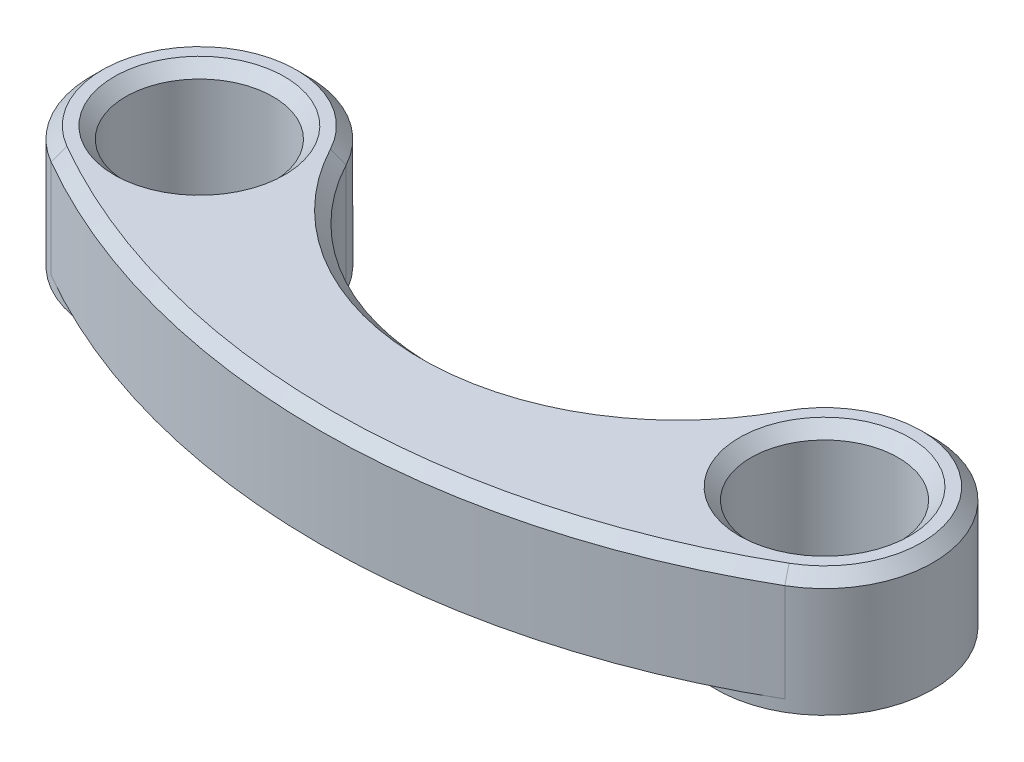
ISO-10303-21;
HEADER;
FILE_DESCRIPTION(('STEP AP214'),'2;1');
FILE_NAME('part.step','',(''),(''),'','','');
FILE_SCHEMA(('AUTOMOTIVE_DESIGN { 1 0 10303 214 1 1 1 1 }'));
ENDSEC;
DATA;
#1=APPLICATION_CONTEXT('core data for automotive mechanical design processes');
#2=APPLICATION_PROTOCOL_DEFINITION('international standard','automotive_design',2000,#1);
#3=PRODUCT_CONTEXT('',#1,'mechanical');
#4=PRODUCT('Part','Part','',(#3));
#5=PRODUCT_RELATED_PRODUCT_CATEGORY('part','',(#4));
#6=PRODUCT_DEFINITION_FORMATION('','',#4);
#7=PRODUCT_DEFINITION_CONTEXT('part definition',#1,'design');
#8=PRODUCT_DEFINITION('design','',#6,#7);
#9=PRODUCT_DEFINITION_SHAPE('','',#8);
#10=(LENGTH_UNIT() NAMED_UNIT(*) SI_UNIT(.MILLI.,.METRE.));
#11=(NAMED_UNIT(*) PLANE_ANGLE_UNIT() SI_UNIT($,.RADIAN.));
#12=(NAMED_UNIT(*) SI_UNIT($,.STERADIAN.) SOLID_ANGLE_UNIT());
#13=UNCERTAINTY_MEASURE_WITH_UNIT(LENGTH_MEASURE(1.E-05),#10,'distance_accuracy_value','');
#14=(GEOMETRIC_REPRESENTATION_CONTEXT(3) GLOBAL_UNCERTAINTY_ASSIGNED_CONTEXT((#13)) GLOBAL_UNIT_ASSIGNED_CONTEXT((#10,
#11,#12)) REPRESENTATION_CONTEXT('',''));
#15=CARTESIAN_POINT('',(0.,0.,0.));
#16=DIRECTION('',(0.,0.,1.));
#17=DIRECTION('',(1.,0.,0.));
#18=AXIS2_PLACEMENT_3D('',#15,#16,#17);
#19=CARTESIAN_POINT('',(5.41265877365273,-10.8,-3.1249999999999));
#20=DIRECTION('',(0.,1.,0.));
#21=DIRECTION('',(0.,0.,1.));
#22=AXIS2_PLACEMENT_3D('',#19,#20,#21);
#23=PLANE('',#22);
#24=CARTESIAN_POINT('',(10.8253175473055,-10.8,6.25000000000005));
#25=DIRECTION('',(0.,-1.,0.));
#26=DIRECTION('',(0.,0.,-1.));
#27=AXIS2_PLACEMENT_3D('',#24,#25,#26);
#28=CIRCLE('',#27,3.75765067213125);
#29=CARTESIAN_POINT('',(12.7041428833711,-10.8,9.50422094061338));
#30=VERTEX_POINT('',#29);
#31=CARTESIAN_POINT('',(7.50675652401322,-10.8,4.48730566788965));
#32=VERTEX_POINT('',#31);
#33=EDGE_CURVE('E109',#30,#32,#28,.T.);
#34=ORIENTED_EDGE('',*,*,#33,.F.);
#35=CARTESIAN_POINT('',(0.,-10.8,-12.4999999999998));
#36=DIRECTION('',(0.,-1.,0.));
#37=DIRECTION('',(0.,0.,1.));
#38=AXIS2_PLACEMENT_3D('',#35,#36,#37);
#39=CIRCLE('',#38,25.4082857667421);
#40=CARTESIAN_POINT('',(-12.7041428833711,-10.8,9.50422094061338));
#41=VERTEX_POINT('',#40);
#42=EDGE_CURVE('E93',#30,#41,#39,.T.);
#43=ORIENTED_EDGE('',*,*,#42,.T.);
#44=CARTESIAN_POINT('',(-10.8253175473054,-10.8,6.25000000000004));
#45=DIRECTION('',(0.,-1.,0.));
#46=DIRECTION('',(0.,0.,-1.));
#47=AXIS2_PLACEMENT_3D('',#44,#45,#46);
#48=CIRCLE('',#47,3.75765067213125);
#49=CARTESIAN_POINT('',(-7.50675652401322,-10.8,4.48730566788966));
#50=VERTEX_POINT('',#49);
#51=EDGE_CURVE('E123',#50,#41,#48,.T.);
#52=ORIENTED_EDGE('',*,*,#51,.F.);
#53=CARTESIAN_POINT('',(0.,-10.8,0.500000000000006));
#54=DIRECTION('',(0.,1.,0.));
#55=DIRECTION('',(0.,0.,1.));
#56=AXIS2_PLACEMENT_3D('',#53,#54,#55);
#57=CIRCLE('',#56,8.5);
#58=EDGE_CURVE('E103',#50,#32,#57,.T.);
#59=ORIENTED_EDGE('',*,*,#58,.T.);
#60=EDGE_LOOP('',(#34,#43,#52,#59));
#61=FACE_BOUND('',#60,.T.);
#62=ADVANCED_FACE('F36',(#61),#23,.F.);
#63=CARTESIAN_POINT('',(5.41265877365273,-7.,-3.1249999999999));
#64=DIRECTION('',(0.,1.,0.));
#65=DIRECTION('',(0.,0.,1.));
#66=AXIS2_PLACEMENT_3D('',#63,#64,#65);
#67=PLANE('',#66);
#68=CARTESIAN_POINT('',(10.8253175473055,-7.,6.25000000000005));
#69=DIRECTION('',(0.,1.,0.));
#70=DIRECTION('',(0.,0.,1.));
#71=AXIS2_PLACEMENT_3D('',#68,#69,#70);
#72=CIRCLE('',#71,2.94999999999999);
#73=CARTESIAN_POINT('',(10.8253175473055,-7.,9.20000000000004));
#74=VERTEX_POINT('',#73);
#75=EDGE_CURVE('E144',#74,#74,#72,.F.);
#76=ORIENTED_EDGE('',*,*,#75,.T.);
#77=EDGE_LOOP('',(#76));
#78=FACE_BOUND('',#77,.T.);
#79=CARTESIAN_POINT('',(0.,-7.,0.500000000000006));
#80=DIRECTION('',(0.,1.,0.));
#81=DIRECTION('',(0.,0.,1.));
#82=AXIS2_PLACEMENT_3D('',#79,#80,#81);
#83=CIRCLE('',#82,8.90000000000002);
#84=CARTESIAN_POINT('',(7.86001565455505,-7.,4.67494358167271));
#85=VERTEX_POINT('',#84);
#86=CARTESIAN_POINT('',(-7.86001565455503,-7.,4.67494358167271));
#87=VERTEX_POINT('',#86);
#88=EDGE_CURVE('E139',#85,#87,#83,.F.);
#89=ORIENTED_EDGE('',*,*,#88,.T.);
#90=CARTESIAN_POINT('',(-10.8253175473054,-7.,6.25000000000004));
#91=DIRECTION('',(0.,1.,0.));
#92=DIRECTION('',(0.,0.,1.));
#93=AXIS2_PLACEMENT_3D('',#90,#91,#92);
#94=CIRCLE('',#93,3.35765067213123);
#95=CARTESIAN_POINT('',(-12.5041428833711,-7.,9.15781077909958));
#96=VERTEX_POINT('',#95);
#97=EDGE_CURVE('E141',#87,#96,#94,.T.);
#98=ORIENTED_EDGE('',*,*,#97,.T.);
#99=CARTESIAN_POINT('',(0.,-7.,-12.4999999999998));
#100=DIRECTION('',(0.,1.,0.));
#101=DIRECTION('',(0.,0.,1.));
#102=AXIS2_PLACEMENT_3D('',#99,#100,#101);
#103=CIRCLE('',#102,25.0082857667421);
#104=CARTESIAN_POINT('',(12.5041428833711,-7.,9.15781077909958));
#105=VERTEX_POINT('',#104);
#106=EDGE_CURVE('E135',#96,#105,#103,.T.);
#107=ORIENTED_EDGE('',*,*,#106,.T.);
#108=CARTESIAN_POINT('',(10.8253175473055,-7.,6.25000000000005));
#109=DIRECTION('',(0.,1.,0.));
#110=DIRECTION('',(0.,0.,1.));
#111=AXIS2_PLACEMENT_3D('',#108,#109,#110);
#112=CIRCLE('',#111,3.35765067213123);
#113=EDGE_CURVE('E137',#105,#85,#112,.T.);
#114=ORIENTED_EDGE('',*,*,#113,.T.);
#115=EDGE_LOOP('',(#89,#98,#107,#114));
#116=FACE_BOUND('',#115,.T.);
#117=CARTESIAN_POINT('',(-10.8253175473054,-7.,6.25000000000004));
#118=DIRECTION('',(0.,1.,0.));
#119=DIRECTION('',(0.,0.,1.));
#120=AXIS2_PLACEMENT_3D('',#117,#118,#119);
#121=CIRCLE('',#120,2.94999999999999);
#122=CARTESIAN_POINT('',(-10.8253175473054,-7.,9.20000000000004));
#123=VERTEX_POINT('',#122);
#124=EDGE_CURVE('E132',#123,#123,#121,.F.);
#125=ORIENTED_EDGE('',*,*,#124,.T.);
#126=EDGE_LOOP('',(#125));
#127=FACE_BOUND('',#126,.T.);
#128=ADVANCED_FACE('F174',(#78,#116,#127),#67,.T.);
#129=CARTESIAN_POINT('',(0.,-10.8,-12.4999999999998));
#130=DIRECTION('',(0.,1.,0.));
#131=DIRECTION('',(0.,0.,1.));
#132=AXIS2_PLACEMENT_3D('',#129,#130,#131);
#133=CYLINDRICAL_SURFACE('',#132,25.4082857667421);
#134=DIRECTION('',(0.,1.,0.));
#135=VECTOR('',#134,1.);
#136=CARTESIAN_POINT('',(12.7041428833711,-10.8,9.50422094061338));
#137=LINE('',#136,#135);
#138=CARTESIAN_POINT('',(12.7041428833711,-7.40000000000002,9.50422094061338));
#139=VERTEX_POINT('',#138);
#140=EDGE_CURVE('E95',#30,#139,#137,.T.);
#141=ORIENTED_EDGE('',*,*,#140,.T.);
#142=CARTESIAN_POINT('',(0.,-7.40000000000002,-12.4999999999998));
#143=DIRECTION('',(0.,1.,0.));
#144=DIRECTION('',(0.,0.,1.));
#145=AXIS2_PLACEMENT_3D('',#142,#143,#144);
#146=CIRCLE('',#145,25.4082857667421);
#147=CARTESIAN_POINT('',(-12.7041428833711,-7.40000000000002,9.50422094061338));
#148=VERTEX_POINT('',#147);
#149=EDGE_CURVE('E45',#139,#148,#146,.F.);
#150=ORIENTED_EDGE('',*,*,#149,.T.);
#151=DIRECTION('',(0.,1.,0.));
#152=VECTOR('',#151,1.);
#153=CARTESIAN_POINT('',(-12.7041428833711,-10.8,9.50422094061338));
#154=LINE('',#153,#152);
#155=EDGE_CURVE('E98',#41,#148,#154,.T.);
#156=ORIENTED_EDGE('',*,*,#155,.F.);
#157=ORIENTED_EDGE('',*,*,#42,.F.);
#158=EDGE_LOOP('',(#141,#150,#156,#157));
#159=FACE_BOUND('',#158,.T.);
#160=ADVANCED_FACE('F94',(#159),#133,.T.);
#161=CARTESIAN_POINT('',(-10.8253175473054,-10.8,6.25000000000004));
#162=DIRECTION('',(0.,1.,0.));
#163=DIRECTION('',(0.,0.,1.));
#164=AXIS2_PLACEMENT_3D('',#161,#162,#163);
#165=CYLINDRICAL_SURFACE('',#164,3.75765067213125);
#166=ORIENTED_EDGE('',*,*,#155,.T.);
#167=CARTESIAN_POINT('',(-10.8253175473054,-7.40000000000002,6.25000000000004));
#168=DIRECTION('',(0.,1.,0.));
#169=DIRECTION('',(0.,0.,1.));
#170=AXIS2_PLACEMENT_3D('',#167,#168,#169);
#171=CIRCLE('',#170,3.75765067213125);
#172=CARTESIAN_POINT('',(-7.50675652401322,-7.40000000000002,4.48730566788966));
#173=VERTEX_POINT('',#172);
#174=EDGE_CURVE('E150',#148,#173,#171,.F.);
#175=ORIENTED_EDGE('',*,*,#174,.T.);
#176=DIRECTION('',(0.,1.,0.));
#177=VECTOR('',#176,1.);
#178=CARTESIAN_POINT('',(-7.50675652401322,-10.8,4.48730566788966));
#179=LINE('',#178,#177);
#180=EDGE_CURVE('E129',#50,#173,#179,.T.);
#181=ORIENTED_EDGE('',*,*,#180,.F.);
#182=ORIENTED_EDGE('',*,*,#51,.T.);
#183=EDGE_LOOP('',(#166,#175,#181,#182));
#184=FACE_BOUND('',#183,.T.);
#185=CARTESIAN_POINT('',(-10.8253175473054,-11.2,6.25000000000004));
#186=DIRECTION('',(0.,-1.,0.));
#187=DIRECTION('',(0.,0.,-1.));
#188=AXIS2_PLACEMENT_3D('',#185,#186,#187);
#189=CIRCLE('',#188,3.75765067213125);
#190=CARTESIAN_POINT('',(-10.8253175473054,-11.2,2.49234932786879));
#191=VERTEX_POINT('',#190);
#192=EDGE_CURVE('E104',#191,#191,#189,.T.);
#193=ORIENTED_EDGE('',*,*,#192,.F.);
#194=EDGE_LOOP('',(#193));
#195=FACE_BOUND('',#194,.T.);
#196=ADVANCED_FACE('F184',(#184,#195),#165,.T.);
#197=CARTESIAN_POINT('',(0.,-10.8,0.500000000000006));
#198=DIRECTION('',(0.,1.,0.));
#199=DIRECTION('',(0.,0.,1.));
#200=AXIS2_PLACEMENT_3D('',#197,#198,#199);
#201=CYLINDRICAL_SURFACE('',#200,8.5);
#202=ORIENTED_EDGE('',*,*,#180,.T.);
#203=CARTESIAN_POINT('',(0.,-7.40000000000002,0.500000000000006));
#204=DIRECTION('',(0.,1.,0.));
#205=DIRECTION('',(0.,0.,1.));
#206=AXIS2_PLACEMENT_3D('',#203,#204,#205);
#207=CIRCLE('',#206,8.5);
#208=CARTESIAN_POINT('',(7.50675652401322,-7.40000000000002,4.48730566788965));
#209=VERTEX_POINT('',#208);
#210=EDGE_CURVE('E61',#173,#209,#207,.T.);
#211=ORIENTED_EDGE('',*,*,#210,.T.);
#212=DIRECTION('',(0.,1.,0.));
#213=VECTOR('',#212,1.);
#214=CARTESIAN_POINT('',(7.50675652401322,-10.8,4.48730566788965));
#215=LINE('',#214,#213);
#216=EDGE_CURVE('E110',#32,#209,#215,.T.);
#217=ORIENTED_EDGE('',*,*,#216,.F.);
#218=ORIENTED_EDGE('',*,*,#58,.F.);
#219=EDGE_LOOP('',(#202,#211,#217,#218));
#220=FACE_BOUND('',#219,.T.);
#221=ADVANCED_FACE('F186',(#220),#201,.F.);
#222=CARTESIAN_POINT('',(10.8253175473055,-10.8,6.25000000000005));
#223=DIRECTION('',(0.,1.,0.));
#224=DIRECTION('',(0.,0.,1.));
#225=AXIS2_PLACEMENT_3D('',#222,#223,#224);
#226=CYLINDRICAL_SURFACE('',#225,3.75765067213125);
#227=ORIENTED_EDGE('',*,*,#216,.T.);
#228=CARTESIAN_POINT('',(10.8253175473055,-7.40000000000002,6.25000000000005));
#229=DIRECTION('',(0.,1.,0.));
#230=DIRECTION('',(0.,0.,1.));
#231=AXIS2_PLACEMENT_3D('',#228,#229,#230);
#232=CIRCLE('',#231,3.75765067213125);
#233=EDGE_CURVE('E53',#209,#139,#232,.F.);
#234=ORIENTED_EDGE('',*,*,#233,.T.);
#235=ORIENTED_EDGE('',*,*,#140,.F.);
#236=ORIENTED_EDGE('',*,*,#33,.T.);
#237=EDGE_LOOP('',(#227,#234,#235,#236));
#238=FACE_BOUND('',#237,.T.);
#239=CARTESIAN_POINT('',(10.8253175473055,-11.2,6.25000000000005));
#240=DIRECTION('',(0.,-1.,0.));
#241=DIRECTION('',(0.,0.,-1.));
#242=AXIS2_PLACEMENT_3D('',#239,#240,#241);
#243=CIRCLE('',#242,3.75765067213125);
#244=CARTESIAN_POINT('',(10.8253175473055,-11.2,2.4923493278688));
#245=VERTEX_POINT('',#244);
#246=EDGE_CURVE('E112',#245,#245,#243,.T.);
#247=ORIENTED_EDGE('',*,*,#246,.F.);
#248=EDGE_LOOP('',(#247));
#249=FACE_BOUND('',#248,.T.);
#250=ADVANCED_FACE('F107',(#238,#249),#226,.T.);
#251=CARTESIAN_POINT('',(-10.8253175473054,-10.8,6.25000000000004));
#252=DIRECTION('',(0.,1.,0.));
#253=DIRECTION('',(0.,0.,1.));
#254=AXIS2_PLACEMENT_3D('',#251,#252,#253);
#255=CYLINDRICAL_SURFACE('',#254,2.55);
#256=CARTESIAN_POINT('',(-10.8253175473054,-7.4,6.25000000000004));
#257=DIRECTION('',(0.,1.,0.));
#258=DIRECTION('',(0.,0.,1.));
#259=AXIS2_PLACEMENT_3D('',#256,#257,#258);
#260=CIRCLE('',#259,2.55);
#261=CARTESIAN_POINT('',(-10.8253175473054,-7.4,8.80000000000004));
#262=VERTEX_POINT('',#261);
#263=EDGE_CURVE('E13',#262,#262,#260,.T.);
#264=CARTESIAN_POINT('',(-10.8253175473054,-11.2,6.25000000000004));
#265=DIRECTION('',(0.,-1.,0.));
#266=DIRECTION('',(0.,0.,-1.));
#267=AXIS2_PLACEMENT_3D('',#264,#265,#266);
#268=CIRCLE('',#267,2.55);
#269=CARTESIAN_POINT('',(-10.8253175473054,-11.2,8.80000000000004));
#270=VERTEX_POINT('',#269);
#271=EDGE_CURVE('E116',#270,#270,#268,.T.);
#272=CARTESIAN_POINT('',(-10.8253175473054,-7.4,8.80000000000004));
#273=CARTESIAN_POINT('',(-10.8253175473054,-7.43958333333333,8.80000000000004));
#274=CARTESIAN_POINT('',(-10.8253175473054,-7.47916666666666,8.80000000000004));
#275=CARTESIAN_POINT('',(-10.8253175473054,-7.55833333333333,8.80000000000004));
#276=CARTESIAN_POINT('',(-10.8253175473054,-7.59791666666666,8.80000000000004));
#277=CARTESIAN_POINT('',(-10.8253175473054,-7.67708333333333,8.80000000000004));
#278=CARTESIAN_POINT('',(-10.8253175473054,-7.71666666666666,8.80000000000004));
#279=CARTESIAN_POINT('',(-10.8253175473054,-7.79583333333333,8.80000000000004));
#280=CARTESIAN_POINT('',(-10.8253175473054,-7.83541666666666,8.80000000000004));
#281=CARTESIAN_POINT('',(-10.8253175473054,-7.91458333333333,8.80000000000004));
#282=CARTESIAN_POINT('',(-10.8253175473054,-7.95416666666666,8.80000000000004));
#283=CARTESIAN_POINT('',(-10.8253175473054,-8.03333333333333,8.80000000000004));
#284=CARTESIAN_POINT('',(-10.8253175473054,-8.07291666666666,8.80000000000004));
#285=CARTESIAN_POINT('',(-10.8253175473054,-8.15208333333333,8.80000000000004));
#286=CARTESIAN_POINT('',(-10.8253175473054,-8.19166666666666,8.80000000000004));
#287=CARTESIAN_POINT('',(-10.8253175473054,-8.27083333333333,8.80000000000004));
#288=CARTESIAN_POINT('',(-10.8253175473054,-8.31041666666666,8.80000000000004));
#289=CARTESIAN_POINT('',(-10.8253175473054,-8.38958333333333,8.80000000000004));
#290=CARTESIAN_POINT('',(-10.8253175473054,-8.42916666666667,8.80000000000004));
#291=CARTESIAN_POINT('',(-10.8253175473054,-8.50833333333333,8.80000000000004));
#292=CARTESIAN_POINT('',(-10.8253175473054,-8.54791666666666,8.80000000000004));
#293=CARTESIAN_POINT('',(-10.8253175473054,-8.62708333333333,8.80000000000004));
#294=CARTESIAN_POINT('',(-10.8253175473054,-8.66666666666666,8.80000000000004));
#295=CARTESIAN_POINT('',(-10.8253175473054,-8.74583333333333,8.80000000000004));
#296=CARTESIAN_POINT('',(-10.8253175473054,-8.78541666666666,8.80000000000004));
#297=CARTESIAN_POINT('',(-10.8253175473054,-8.86458333333333,8.80000000000004));
#298=CARTESIAN_POINT('',(-10.8253175473054,-8.90416666666667,8.80000000000004));
#299=CARTESIAN_POINT('',(-10.8253175473054,-8.98333333333333,8.80000000000004));
#300=CARTESIAN_POINT('',(-10.8253175473054,-9.02291666666667,8.80000000000004));
#301=CARTESIAN_POINT('',(-10.8253175473054,-9.10208333333333,8.80000000000004));
#302=CARTESIAN_POINT('',(-10.8253175473054,-9.14166666666666,8.80000000000004));
#303=CARTESIAN_POINT('',(-10.8253175473054,-9.22083333333333,8.80000000000004));
#304=CARTESIAN_POINT('',(-10.8253175473054,-9.26041666666666,8.80000000000004));
#305=CARTESIAN_POINT('',(-10.8253175473054,-9.33958333333333,8.80000000000004));
#306=CARTESIAN_POINT('',(-10.8253175473054,-9.37916666666666,8.80000000000004));
#307=CARTESIAN_POINT('',(-10.8253175473054,-9.45833333333333,8.80000000000004));
#308=CARTESIAN_POINT('',(-10.8253175473054,-9.49791666666667,8.80000000000004));
#309=CARTESIAN_POINT('',(-10.8253175473054,-9.57708333333333,8.80000000000004));
#310=CARTESIAN_POINT('',(-10.8253175473054,-9.61666666666667,8.80000000000004));
#311=CARTESIAN_POINT('',(-10.8253175473054,-9.69583333333333,8.80000000000004));
#312=CARTESIAN_POINT('',(-10.8253175473054,-9.73541666666666,8.80000000000004));
#313=CARTESIAN_POINT('',(-10.8253175473054,-9.81458333333333,8.80000000000004));
#314=CARTESIAN_POINT('',(-10.8253175473054,-9.85416666666667,8.80000000000004));
#315=CARTESIAN_POINT('',(-10.8253175473054,-9.93333333333333,8.80000000000004));
#316=CARTESIAN_POINT('',(-10.8253175473054,-9.97291666666666,8.80000000000004));
#317=CARTESIAN_POINT('',(-10.8253175473054,-10.0520833333333,8.80000000000004));
#318=CARTESIAN_POINT('',(-10.8253175473054,-10.0916666666667,8.80000000000004));
#319=CARTESIAN_POINT('',(-10.8253175473054,-10.1708333333333,8.80000000000004));
#320=CARTESIAN_POINT('',(-10.8253175473054,-10.2104166666667,8.80000000000004));
#321=CARTESIAN_POINT('',(-10.8253175473054,-10.2895833333333,8.80000000000004));
#322=CARTESIAN_POINT('',(-10.8253175473054,-10.3291666666667,8.80000000000004));
#323=CARTESIAN_POINT('',(-10.8253175473054,-10.4083333333333,8.80000000000004));
#324=CARTESIAN_POINT('',(-10.8253175473054,-10.4479166666667,8.80000000000004));
#325=CARTESIAN_POINT('',(-10.8253175473054,-10.5270833333333,8.80000000000004));
#326=CARTESIAN_POINT('',(-10.8253175473054,-10.5666666666667,8.80000000000004));
#327=CARTESIAN_POINT('',(-10.8253175473054,-10.6458333333333,8.80000000000004));
#328=CARTESIAN_POINT('',(-10.8253175473054,-10.6854166666667,8.80000000000004));
#329=CARTESIAN_POINT('',(-10.8253175473054,-10.7645833333333,8.80000000000004));
#330=CARTESIAN_POINT('',(-10.8253175473054,-10.8041666666667,8.80000000000004));
#331=CARTESIAN_POINT('',(-10.8253175473054,-10.8833333333333,8.80000000000004));
#332=CARTESIAN_POINT('',(-10.8253175473054,-10.9229166666667,8.80000000000004));
#333=CARTESIAN_POINT('',(-10.8253175473054,-11.0020833333333,8.80000000000004));
#334=CARTESIAN_POINT('',(-10.8253175473054,-11.0416666666667,8.80000000000004));
#335=CARTESIAN_POINT('',(-10.8253175473054,-11.1208333333333,8.80000000000004));
#336=CARTESIAN_POINT('',(-10.8253175473054,-11.1604166666667,8.80000000000004));
#337=CARTESIAN_POINT('',(-10.8253175473054,-11.2,8.80000000000004));
#338=B_SPLINE_CURVE_WITH_KNOTS('',3,(#272,#273,#274,#275,#276,#277,#278,#279,#280,#281,#282,
#283,#284,#285,#286,#287,#288,#289,#290,#291,#292,#293,#294,#295,#296,#297,#298,#299,#300,#301,
#302,#303,#304,#305,#306,#307,#308,#309,#310,#311,#312,#313,#314,#315,#316,#317,#318,#319,#320,
#321,#322,#323,#324,#325,#326,#327,#328,#329,#330,#331,#332,#333,#334,#335,#336,#337),
.UNSPECIFIED.,.F.,.F.,(4,2,2,2,2,2,2,2,2,2,2,2,2,2,2,2,2,2,2,2,2,2,2,2,2,2,2,2,2,2,2,2,4),(0.,
0.118750000000001,0.237500000000001,0.356250000000001,0.475,0.593750000000001,0.712500000000001,
0.83125,0.950000000000001,1.06875,1.1875,1.30625,1.425,1.54375,1.6625,1.78125,1.9,2.01875,
2.1375,2.25625,2.375,2.49375,2.6125,2.73125,2.85,2.96875,3.0875,3.20625,3.325,3.44375,3.5625,
3.68125,3.8),.UNSPECIFIED.);
#339=EDGE_CURVE('BSEAM193',#262,#270,#338,.T.);
#340=ORIENTED_EDGE('',*,*,#263,.T.);
#341=ORIENTED_EDGE('',*,*,#271,.T.);
#342=ORIENTED_EDGE('',*,*,#339,.T.);
#343=ORIENTED_EDGE('',*,*,#339,.F.);
#344=EDGE_LOOP('',(#340,#342,#341,#343));
#345=FACE_BOUND('',#344,.T.);
#346=ADVANCED_FACE('F193',(#345),#255,.F.);
#347=CARTESIAN_POINT('',(10.8253175473055,-10.8,6.25000000000005));
#348=DIRECTION('',(0.,1.,0.));
#349=DIRECTION('',(0.,0.,1.));
#350=AXIS2_PLACEMENT_3D('',#347,#348,#349);
#351=CYLINDRICAL_SURFACE('',#350,2.55);
#352=CARTESIAN_POINT('',(10.8253175473055,-7.4,6.25000000000005));
#353=DIRECTION('',(0.,1.,0.));
#354=DIRECTION('',(0.,0.,1.));
#355=AXIS2_PLACEMENT_3D('',#352,#353,#354);
#356=CIRCLE('',#355,2.55);
#357=CARTESIAN_POINT('',(10.8253175473055,-7.4,8.80000000000005));
#358=VERTEX_POINT('',#357);
#359=EDGE_CURVE('E147',#358,#358,#356,.T.);
#360=CARTESIAN_POINT('',(10.8253175473055,-11.2,6.25000000000005));
#361=DIRECTION('',(0.,-1.,0.));
#362=DIRECTION('',(0.,0.,-1.));
#363=AXIS2_PLACEMENT_3D('',#360,#361,#362);
#364=CIRCLE('',#363,2.55);
#365=CARTESIAN_POINT('',(10.8253175473055,-11.2,8.80000000000005));
#366=VERTEX_POINT('',#365);
#367=EDGE_CURVE('E113',#366,#366,#364,.T.);
#368=CARTESIAN_POINT('',(10.8253175473055,-7.4,8.80000000000005));
#369=CARTESIAN_POINT('',(10.8253175473055,-7.43958333333333,8.80000000000005));
#370=CARTESIAN_POINT('',(10.8253175473055,-7.47916666666666,8.80000000000005));
#371=CARTESIAN_POINT('',(10.8253175473055,-7.55833333333333,8.80000000000005));
#372=CARTESIAN_POINT('',(10.8253175473055,-7.59791666666666,8.80000000000005));
#373=CARTESIAN_POINT('',(10.8253175473055,-7.67708333333333,8.80000000000005));
#374=CARTESIAN_POINT('',(10.8253175473055,-7.71666666666666,8.80000000000005));
#375=CARTESIAN_POINT('',(10.8253175473055,-7.79583333333333,8.80000000000005));
#376=CARTESIAN_POINT('',(10.8253175473055,-7.83541666666666,8.80000000000005));
#377=CARTESIAN_POINT('',(10.8253175473055,-7.91458333333333,8.80000000000005));
#378=CARTESIAN_POINT('',(10.8253175473055,-7.95416666666666,8.80000000000005));
#379=CARTESIAN_POINT('',(10.8253175473055,-8.03333333333333,8.80000000000005));
#380=CARTESIAN_POINT('',(10.8253175473055,-8.07291666666666,8.80000000000005));
#381=CARTESIAN_POINT('',(10.8253175473055,-8.15208333333333,8.80000000000005));
#382=CARTESIAN_POINT('',(10.8253175473055,-8.19166666666666,8.80000000000005));
#383=CARTESIAN_POINT('',(10.8253175473055,-8.27083333333333,8.80000000000005));
#384=CARTESIAN_POINT('',(10.8253175473055,-8.31041666666666,8.80000000000005));
#385=CARTESIAN_POINT('',(10.8253175473055,-8.38958333333333,8.80000000000005));
#386=CARTESIAN_POINT('',(10.8253175473055,-8.42916666666667,8.80000000000005));
#387=CARTESIAN_POINT('',(10.8253175473055,-8.50833333333333,8.80000000000005));
#388=CARTESIAN_POINT('',(10.8253175473055,-8.54791666666666,8.80000000000005));
#389=CARTESIAN_POINT('',(10.8253175473055,-8.62708333333333,8.80000000000005));
#390=CARTESIAN_POINT('',(10.8253175473055,-8.66666666666666,8.80000000000005));
#391=CARTESIAN_POINT('',(10.8253175473055,-8.74583333333333,8.80000000000005));
#392=CARTESIAN_POINT('',(10.8253175473055,-8.78541666666666,8.80000000000005));
#393=CARTESIAN_POINT('',(10.8253175473055,-8.86458333333333,8.80000000000005));
#394=CARTESIAN_POINT('',(10.8253175473055,-8.90416666666667,8.80000000000005));
#395=CARTESIAN_POINT('',(10.8253175473055,-8.98333333333333,8.80000000000005));
#396=CARTESIAN_POINT('',(10.8253175473055,-9.02291666666667,8.80000000000005));
#397=CARTESIAN_POINT('',(10.8253175473055,-9.10208333333333,8.80000000000005));
#398=CARTESIAN_POINT('',(10.8253175473055,-9.14166666666666,8.80000000000005));
#399=CARTESIAN_POINT('',(10.8253175473055,-9.22083333333333,8.80000000000005));
#400=CARTESIAN_POINT('',(10.8253175473055,-9.26041666666666,8.80000000000005));
#401=CARTESIAN_POINT('',(10.8253175473055,-9.33958333333333,8.80000000000005));
#402=CARTESIAN_POINT('',(10.8253175473055,-9.37916666666666,8.80000000000005));
#403=CARTESIAN_POINT('',(10.8253175473055,-9.45833333333333,8.80000000000005));
#404=CARTESIAN_POINT('',(10.8253175473055,-9.49791666666667,8.80000000000005));
#405=CARTESIAN_POINT('',(10.8253175473055,-9.57708333333333,8.80000000000005));
#406=CARTESIAN_POINT('',(10.8253175473055,-9.61666666666667,8.80000000000005));
#407=CARTESIAN_POINT('',(10.8253175473055,-9.69583333333333,8.80000000000005));
#408=CARTESIAN_POINT('',(10.8253175473055,-9.73541666666666,8.80000000000005));
#409=CARTESIAN_POINT('',(10.8253175473055,-9.81458333333333,8.80000000000005));
#410=CARTESIAN_POINT('',(10.8253175473055,-9.85416666666667,8.80000000000005));
#411=CARTESIAN_POINT('',(10.8253175473055,-9.93333333333333,8.80000000000005));
#412=CARTESIAN_POINT('',(10.8253175473055,-9.97291666666666,8.80000000000005));
#413=CARTESIAN_POINT('',(10.8253175473055,-10.0520833333333,8.80000000000005));
#414=CARTESIAN_POINT('',(10.8253175473055,-10.0916666666667,8.80000000000005));
#415=CARTESIAN_POINT('',(10.8253175473055,-10.1708333333333,8.80000000000005));
#416=CARTESIAN_POINT('',(10.8253175473055,-10.2104166666667,8.80000000000005));
#417=CARTESIAN_POINT('',(10.8253175473055,-10.2895833333333,8.80000000000005));
#418=CARTESIAN_POINT('',(10.8253175473055,-10.3291666666667,8.80000000000005));
#419=CARTESIAN_POINT('',(10.8253175473055,-10.4083333333333,8.80000000000005));
#420=CARTESIAN_POINT('',(10.8253175473055,-10.4479166666667,8.80000000000005));
#421=CARTESIAN_POINT('',(10.8253175473055,-10.5270833333333,8.80000000000005));
#422=CARTESIAN_POINT('',(10.8253175473055,-10.5666666666667,8.80000000000005));
#423=CARTESIAN_POINT('',(10.8253175473055,-10.6458333333333,8.80000000000005));
#424=CARTESIAN_POINT('',(10.8253175473055,-10.6854166666667,8.80000000000005));
#425=CARTESIAN_POINT('',(10.8253175473055,-10.7645833333333,8.80000000000005));
#426=CARTESIAN_POINT('',(10.8253175473055,-10.8041666666667,8.80000000000005));
#427=CARTESIAN_POINT('',(10.8253175473055,-10.8833333333333,8.80000000000005));
#428=CARTESIAN_POINT('',(10.8253175473055,-10.9229166666667,8.80000000000005));
#429=CARTESIAN_POINT('',(10.8253175473055,-11.0020833333333,8.80000000000005));
#430=CARTESIAN_POINT('',(10.8253175473055,-11.0416666666667,8.80000000000005));
#431=CARTESIAN_POINT('',(10.8253175473055,-11.1208333333333,8.80000000000005));
#432=CARTESIAN_POINT('',(10.8253175473055,-11.1604166666667,8.80000000000005));
#433=CARTESIAN_POINT('',(10.8253175473055,-11.2,8.80000000000005));
#434=B_SPLINE_CURVE_WITH_KNOTS('',3,(#368,#369,#370,#371,#372,#373,#374,#375,#376,#377,#378,
#379,#380,#381,#382,#383,#384,#385,#386,#387,#388,#389,#390,#391,#392,#393,#394,#395,#396,#397,
#398,#399,#400,#401,#402,#403,#404,#405,#406,#407,#408,#409,#410,#411,#412,#413,#414,#415,#416,
#417,#418,#419,#420,#421,#422,#423,#424,#425,#426,#427,#428,#429,#430,#431,#432,#433),
.UNSPECIFIED.,.F.,.F.,(4,2,2,2,2,2,2,2,2,2,2,2,2,2,2,2,2,2,2,2,2,2,2,2,2,2,2,2,2,2,2,2,4),(0.,
0.118750000000001,0.237500000000001,0.356250000000001,0.475,0.593750000000001,0.712500000000001,
0.83125,0.950000000000001,1.06875,1.1875,1.30625,1.425,1.54375,1.6625,1.78125,1.9,2.01875,
2.1375,2.25625,2.375,2.49375,2.6125,2.73125,2.85,2.96875,3.0875,3.20625,3.325,3.44375,3.5625,
3.68125,3.8),.UNSPECIFIED.);
#435=EDGE_CURVE('BSEAM206',#358,#366,#434,.T.);
#436=ORIENTED_EDGE('',*,*,#359,.T.);
#437=ORIENTED_EDGE('',*,*,#367,.T.);
#438=ORIENTED_EDGE('',*,*,#435,.T.);
#439=ORIENTED_EDGE('',*,*,#435,.F.);
#440=EDGE_LOOP('',(#436,#438,#437,#439));
#441=FACE_BOUND('',#440,.T.);
#442=ADVANCED_FACE('F206',(#441),#351,.F.);
#443=CARTESIAN_POINT('',(-10.8253175473054,-11.2,6.25000000000004));
#444=DIRECTION('',(0.,-1.,0.));
#445=DIRECTION('',(0.,0.,-1.));
#446=AXIS2_PLACEMENT_3D('',#443,#444,#445);
#447=PLANE('',#446);
#448=ORIENTED_EDGE('',*,*,#192,.T.);
#449=EDGE_LOOP('',(#448));
#450=FACE_BOUND('',#449,.T.);
#451=ORIENTED_EDGE('',*,*,#271,.F.);
#452=EDGE_LOOP('',(#451));
#453=FACE_BOUND('',#452,.T.);
#454=ADVANCED_FACE('F210',(#450,#453),#447,.T.);
#455=CARTESIAN_POINT('',(10.8253175473055,-11.2,6.25000000000005));
#456=DIRECTION('',(0.,-1.,0.));
#457=DIRECTION('',(0.,0.,-1.));
#458=AXIS2_PLACEMENT_3D('',#455,#456,#457);
#459=PLANE('',#458);
#460=ORIENTED_EDGE('',*,*,#246,.T.);
#461=EDGE_LOOP('',(#460));
#462=FACE_BOUND('',#461,.T.);
#463=ORIENTED_EDGE('',*,*,#367,.F.);
#464=EDGE_LOOP('',(#463));
#465=FACE_BOUND('',#464,.T.);
#466=ADVANCED_FACE('F214',(#462,#465),#459,.T.);
#467=CARTESIAN_POINT('',(10.8253175473055,-7.,6.25000000000005));
#468=DIRECTION('',(0.,1.,0.));
#469=DIRECTION('',(0.,0.,1.));
#470=AXIS2_PLACEMENT_3D('',#467,#468,#469);
#471=CONICAL_SURFACE('',#470,2.94999999999999,0.785398163397443);
#472=ORIENTED_EDGE('',*,*,#359,.F.);
#473=EDGE_LOOP('',(#472));
#474=FACE_BOUND('',#473,.T.);
#475=ORIENTED_EDGE('',*,*,#75,.F.);
#476=EDGE_LOOP('',(#475));
#477=FACE_BOUND('',#476,.T.);
#478=ADVANCED_FACE('F217',(#474,#477),#471,.F.);
#479=CARTESIAN_POINT('',(10.8253175473055,-7.40000000000002,6.25000000000005));
#480=DIRECTION('',(0.,-1.,0.));
#481=DIRECTION('',(0.,0.,-1.));
#482=AXIS2_PLACEMENT_3D('',#479,#480,#481);
#483=CONICAL_SURFACE('',#482,3.75765067213125,0.78539816339745);
#484=DIRECTION('',(-0.624479816805426,-0.707106781186546,-0.331700103109216));
#485=VECTOR('',#484,1.);
#486=CARTESIAN_POINT('',(7.86001565455505,-7.,4.67494358167271));
#487=LINE('',#486,#485);
#488=EDGE_CURVE('E159',#85,#209,#487,.T.);
#489=ORIENTED_EDGE('',*,*,#488,.F.);
#490=ORIENTED_EDGE('',*,*,#113,.F.);
#491=DIRECTION('',(-0.353553390593276,0.707106781186546,-0.612372435695795));
#492=VECTOR('',#491,1.);
#493=CARTESIAN_POINT('',(12.7041428833711,-7.40000000000002,9.50422094061338));
#494=LINE('',#493,#492);
#495=EDGE_CURVE('E40',#139,#105,#494,.T.);
#496=ORIENTED_EDGE('',*,*,#495,.F.);
#497=ORIENTED_EDGE('',*,*,#233,.F.);
#498=EDGE_LOOP('',(#489,#490,#496,#497));
#499=FACE_BOUND('',#498,.T.);
#500=ADVANCED_FACE('F172',(#499),#483,.T.);
#501=CARTESIAN_POINT('',(0.,-7.40000000000002,-12.4999999999998));
#502=DIRECTION('',(0.,-1.,0.));
#503=DIRECTION('',(0.,0.,-1.));
#504=AXIS2_PLACEMENT_3D('',#501,#502,#503);
#505=CONICAL_SURFACE('',#504,25.4082857667421,0.785398163397453);
#506=ORIENTED_EDGE('',*,*,#495,.T.);
#507=ORIENTED_EDGE('',*,*,#106,.F.);
#508=DIRECTION('',(0.353553390593276,0.707106781186546,-0.612372435695795));
#509=VECTOR('',#508,1.);
#510=CARTESIAN_POINT('',(-12.7041428833711,-7.40000000000002,9.50422094061338));
#511=LINE('',#510,#509);
#512=EDGE_CURVE('E158',#148,#96,#511,.T.);
#513=ORIENTED_EDGE('',*,*,#512,.F.);
#514=ORIENTED_EDGE('',*,*,#149,.F.);
#515=EDGE_LOOP('',(#506,#507,#513,#514));
#516=FACE_BOUND('',#515,.T.);
#517=ADVANCED_FACE('F168',(#516),#505,.T.);
#518=CARTESIAN_POINT('',(0.,-7.40000000000002,0.500000000000006));
#519=DIRECTION('',(0.,1.,0.));
#520=DIRECTION('',(0.,0.,1.));
#521=AXIS2_PLACEMENT_3D('',#518,#519,#520);
#522=CONICAL_SURFACE('',#521,8.5,0.78539816339745);
#523=ORIENTED_EDGE('',*,*,#488,.T.);
#524=ORIENTED_EDGE('',*,*,#210,.F.);
#525=DIRECTION('',(0.624479816805426,-0.707106781186546,-0.331700103109216));
#526=VECTOR('',#525,1.);
#527=CARTESIAN_POINT('',(-7.86001565455503,-7.,4.67494358167271));
#528=LINE('',#527,#526);
#529=EDGE_CURVE('E156',#87,#173,#528,.T.);
#530=ORIENTED_EDGE('',*,*,#529,.F.);
#531=ORIENTED_EDGE('',*,*,#88,.F.);
#532=EDGE_LOOP('',(#523,#524,#530,#531));
#533=FACE_BOUND('',#532,.T.);
#534=ADVANCED_FACE('F181',(#533),#522,.F.);
#535=CARTESIAN_POINT('',(-10.8253175473054,-7.40000000000002,6.25000000000004));
#536=DIRECTION('',(0.,-1.,0.));
#537=DIRECTION('',(0.,0.,-1.));
#538=AXIS2_PLACEMENT_3D('',#535,#536,#537);
#539=CONICAL_SURFACE('',#538,3.75765067213125,0.785398163397451);
#540=ORIENTED_EDGE('',*,*,#512,.T.);
#541=ORIENTED_EDGE('',*,*,#97,.F.);
#542=ORIENTED_EDGE('',*,*,#529,.T.);
#543=ORIENTED_EDGE('',*,*,#174,.F.);
#544=EDGE_LOOP('',(#540,#541,#542,#543));
#545=FACE_BOUND('',#544,.T.);
#546=ADVANCED_FACE('F179',(#545),#539,.T.);
#547=CARTESIAN_POINT('',(-10.8253175473054,-7.,6.25000000000004));
#548=DIRECTION('',(0.,1.,0.));
#549=DIRECTION('',(0.,0.,1.));
#550=AXIS2_PLACEMENT_3D('',#547,#548,#549);
#551=CONICAL_SURFACE('',#550,2.94999999999999,0.785398163397443);
#552=ORIENTED_EDGE('',*,*,#263,.F.);
#553=EDGE_LOOP('',(#552));
#554=FACE_BOUND('',#553,.T.);
#555=ORIENTED_EDGE('',*,*,#124,.F.);
#556=EDGE_LOOP('',(#555));
#557=FACE_BOUND('',#556,.T.);
#558=ADVANCED_FACE('F38',(#554,#557),#551,.F.);
#559=CLOSED_SHELL('',(#62,#128,#160,#196,#221,#250,#346,#442,#454,#466,#478,#500,#517,#534,#546,#558));
#560=MANIFOLD_SOLID_BREP('B2',#559);
#561=ADVANCED_BREP_SHAPE_REPRESENTATION('',(#18,#560),#14);
#562=SHAPE_DEFINITION_REPRESENTATION(#9,#561);
ENDSEC;
END-ISO-10303-21;
